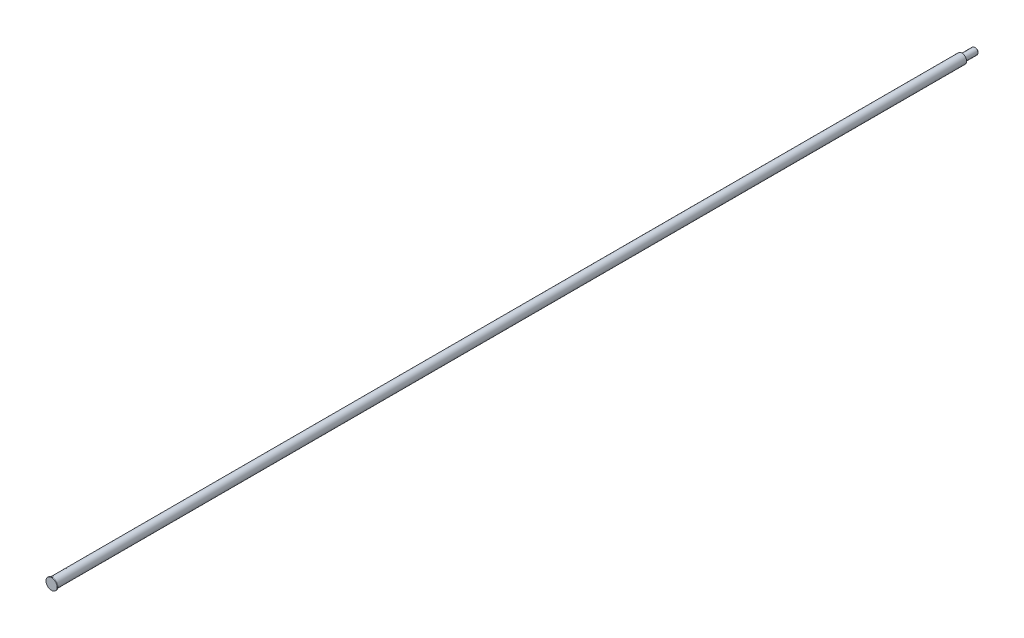
ISO-10303-21;
HEADER;
FILE_DESCRIPTION(('STEP AP214'),'2;1');
FILE_NAME('part.step','',(''),(''),'','','');
FILE_SCHEMA(('AUTOMOTIVE_DESIGN { 1 0 10303 214 1 1 1 1 }'));
ENDSEC;
DATA;
#1=APPLICATION_CONTEXT('core data for automotive mechanical design processes');
#2=APPLICATION_PROTOCOL_DEFINITION('international standard','automotive_design',2000,#1);
#3=PRODUCT_CONTEXT('',#1,'mechanical');
#4=PRODUCT('Part','Part','',(#3));
#5=PRODUCT_RELATED_PRODUCT_CATEGORY('part','',(#4));
#6=PRODUCT_DEFINITION_FORMATION('','',#4);
#7=PRODUCT_DEFINITION_CONTEXT('part definition',#1,'design');
#8=PRODUCT_DEFINITION('design','',#6,#7);
#9=PRODUCT_DEFINITION_SHAPE('','',#8);
#10=(LENGTH_UNIT() NAMED_UNIT(*) SI_UNIT(.MILLI.,.METRE.));
#11=(NAMED_UNIT(*) PLANE_ANGLE_UNIT() SI_UNIT($,.RADIAN.));
#12=(NAMED_UNIT(*) SI_UNIT($,.STERADIAN.) SOLID_ANGLE_UNIT());
#13=UNCERTAINTY_MEASURE_WITH_UNIT(LENGTH_MEASURE(1.E-05),#10,'distance_accuracy_value','');
#14=(GEOMETRIC_REPRESENTATION_CONTEXT(3) GLOBAL_UNCERTAINTY_ASSIGNED_CONTEXT((#13)) GLOBAL_UNIT_ASSIGNED_CONTEXT((#10,
#11,#12)) REPRESENTATION_CONTEXT('',''));
#15=CARTESIAN_POINT('',(0.,0.,0.));
#16=DIRECTION('',(0.,0.,1.));
#17=DIRECTION('',(1.,0.,0.));
#18=AXIS2_PLACEMENT_3D('',#15,#16,#17);
#19=CARTESIAN_POINT('',(0.,0.,0.));
#20=DIRECTION('',(0.,0.,-0.999999999999997));
#21=DIRECTION('',(-1.,0.,0.));
#22=AXIS2_PLACEMENT_3D('',#19,#20,#21);
#23=CYLINDRICAL_SURFACE('',#22,10.250000000029);
#24=CARTESIAN_POINT('',(0.,0.,0.));
#25=DIRECTION('',(0.,0.,-0.999999999999997));
#26=DIRECTION('',(-1.,0.,0.));
#27=AXIS2_PLACEMENT_3D('',#24,#25,#26);
#28=CIRCLE('',#27,10.250000000029);
#29=CARTESIAN_POINT('',(-10.250000000029,0.,0.));
#30=VERTEX_POINT('',#29);
#31=EDGE_CURVE('E12',#30,#30,#28,.T.);
#32=ORIENTED_EDGE('',*,*,#31,.T.);
#33=EDGE_LOOP('',(#32));
#34=FACE_BOUND('',#33,.T.);
#35=CARTESIAN_POINT('',(0.,0.,-1.60019999996042));
#36=DIRECTION('',(0.,0.,-0.999999999999997));
#37=DIRECTION('',(-1.,0.,0.));
#38=AXIS2_PLACEMENT_3D('',#35,#36,#37);
#39=CIRCLE('',#38,10.250000000029);
#40=CARTESIAN_POINT('',(-10.250000000029,0.,-1.60019999996042));
#41=VERTEX_POINT('',#40);
#42=EDGE_CURVE('E68',#41,#41,#39,.T.);
#43=ORIENTED_EDGE('',*,*,#42,.F.);
#44=EDGE_LOOP('',(#43));
#45=FACE_BOUND('',#44,.T.);
#46=ADVANCED_FACE('F40',(#34,#45),#23,.T.);
#47=CARTESIAN_POINT('',(10.250000000029,0.,0.));
#48=DIRECTION('',(0.,0.,0.999999999999997));
#49=DIRECTION('',(1.,0.,0.));
#50=AXIS2_PLACEMENT_3D('',#47,#48,#49);
#51=PLANE('',#50);
#52=ORIENTED_EDGE('',*,*,#31,.F.);
#53=EDGE_LOOP('',(#52));
#54=FACE_BOUND('',#53,.T.);
#55=ADVANCED_FACE('F76',(#54),#51,.T.);
#56=CARTESIAN_POINT('',(2.08569620855723E-13,0.,-1703.10019999999));
#57=DIRECTION('',(0.,0.,-0.999999999999997));
#58=DIRECTION('',(-1.,0.,0.));
#59=AXIS2_PLACEMENT_3D('',#56,#57,#58);
#60=PLANE('',#59);
#61=CARTESIAN_POINT('',(2.08569620855723E-13,0.,-1703.10019999999));
#62=DIRECTION('',(0.,0.,-0.999999999999997));
#63=DIRECTION('',(-1.,0.,0.));
#64=AXIS2_PLACEMENT_3D('',#61,#62,#63);
#65=CIRCLE('',#64,4.75000000000176);
#66=CARTESIAN_POINT('',(-4.75000000000155,0.,-1703.10019999999));
#67=VERTEX_POINT('',#66);
#68=EDGE_CURVE('E46',#67,#67,#65,.T.);
#69=ORIENTED_EDGE('',*,*,#68,.T.);
#70=EDGE_LOOP('',(#69));
#71=FACE_BOUND('',#70,.T.);
#72=ADVANCED_FACE('F80',(#71),#60,.T.);
#73=CARTESIAN_POINT('',(2.08569620855723E-13,0.,-1703.10019999999));
#74=DIRECTION('',(0.,0.,0.999999999999997));
#75=DIRECTION('',(1.,0.,0.));
#76=AXIS2_PLACEMENT_3D('',#73,#74,#75);
#77=CONICAL_SURFACE('',#76,4.75000000000176,0.785398163399052);
#78=CARTESIAN_POINT('',(2.0841654000583E-13,0.,-1701.85019999999));
#79=DIRECTION('',(0.,0.,-0.999999999999997));
#80=DIRECTION('',(-1.,0.,0.));
#81=AXIS2_PLACEMENT_3D('',#78,#79,#80);
#82=CIRCLE('',#81,6.00000000000041);
#83=CARTESIAN_POINT('',(-6.0000000000002,0.,-1701.85019999999));
#84=VERTEX_POINT('',#83);
#85=EDGE_CURVE('E50',#84,#84,#82,.T.);
#86=ORIENTED_EDGE('',*,*,#85,.T.);
#87=EDGE_LOOP('',(#86));
#88=FACE_BOUND('',#87,.T.);
#89=ORIENTED_EDGE('',*,*,#68,.F.);
#90=EDGE_LOOP('',(#89));
#91=FACE_BOUND('',#90,.T.);
#92=ADVANCED_FACE('F85',(#88,#91),#77,.T.);
#93=CARTESIAN_POINT('',(0.,0.,0.));
#94=DIRECTION('',(0.,0.,-0.999999999999997));
#95=DIRECTION('',(-1.,0.,0.));
#96=AXIS2_PLACEMENT_3D('',#93,#94,#95);
#97=CYLINDRICAL_SURFACE('',#96,6.00000000000038);
#98=CARTESIAN_POINT('',(2.05661084707747E-13,0.,-1679.35019999998));
#99=DIRECTION('',(0.,0.,-0.999999999999997));
#100=DIRECTION('',(-1.,0.,0.));
#101=AXIS2_PLACEMENT_3D('',#98,#99,#100);
#102=CIRCLE('',#101,6.00000000000035);
#103=CARTESIAN_POINT('',(-6.00000000000015,0.,-1679.35019999998));
#104=VERTEX_POINT('',#103);
#105=EDGE_CURVE('E54',#104,#104,#102,.T.);
#106=ORIENTED_EDGE('',*,*,#105,.T.);
#107=EDGE_LOOP('',(#106));
#108=FACE_BOUND('',#107,.T.);
#109=ORIENTED_EDGE('',*,*,#85,.F.);
#110=EDGE_LOOP('',(#109));
#111=FACE_BOUND('',#110,.T.);
#112=ADVANCED_FACE('F90',(#108,#111),#97,.T.);
#113=CARTESIAN_POINT('',(2.05661084707747E-13,0.,-1679.35019999998));
#114=DIRECTION('',(0.,0.,-0.999999999999997));
#115=DIRECTION('',(-1.,0.,0.));
#116=AXIS2_PLACEMENT_3D('',#113,#114,#115);
#117=CONICAL_SURFACE('',#116,6.00000000000035,0.785398163397331);
#118=CARTESIAN_POINT('',(2.0550800385785E-13,0.,-1678.10019999995));
#119=DIRECTION('',(0.,0.,-0.999999999999997));
#120=DIRECTION('',(-1.,0.,0.));
#121=AXIS2_PLACEMENT_3D('',#118,#119,#120);
#122=CIRCLE('',#121,4.74999999997336);
#123=CARTESIAN_POINT('',(-4.74999999997315,0.,-1678.10019999995));
#124=VERTEX_POINT('',#123);
#125=EDGE_CURVE('E59',#124,#124,#122,.T.);
#126=ORIENTED_EDGE('',*,*,#125,.T.);
#127=EDGE_LOOP('',(#126));
#128=FACE_BOUND('',#127,.T.);
#129=ORIENTED_EDGE('',*,*,#105,.F.);
#130=EDGE_LOOP('',(#129));
#131=FACE_BOUND('',#130,.T.);
#132=ADVANCED_FACE('F94',(#128,#131),#117,.T.);
#133=CARTESIAN_POINT('',(4.74999999997357,0.,-1678.10019999995));
#134=DIRECTION('',(0.,0.,-0.999999999999997));
#135=DIRECTION('',(-1.,0.,0.));
#136=AXIS2_PLACEMENT_3D('',#133,#134,#135);
#137=PLANE('',#136);
#138=CARTESIAN_POINT('',(2.0550800385785E-13,0.,-1678.10019999995));
#139=DIRECTION('',(0.,0.,-0.999999999999997));
#140=DIRECTION('',(-1.,0.,0.));
#141=AXIS2_PLACEMENT_3D('',#138,#139,#140);
#142=CIRCLE('',#141,8.75000000002894);
#143=CARTESIAN_POINT('',(-8.75000000002873,0.,-1678.10019999995));
#144=VERTEX_POINT('',#143);
#145=EDGE_CURVE('E62',#144,#144,#142,.T.);
#146=ORIENTED_EDGE('',*,*,#145,.T.);
#147=EDGE_LOOP('',(#146));
#148=FACE_BOUND('',#147,.T.);
#149=ORIENTED_EDGE('',*,*,#125,.F.);
#150=EDGE_LOOP('',(#149));
#151=FACE_BOUND('',#150,.T.);
#152=ADVANCED_FACE('F98',(#148,#151),#137,.T.);
#153=CARTESIAN_POINT('',(0.,0.,0.));
#154=DIRECTION('',(0.,0.,-0.999999999999997));
#155=DIRECTION('',(-1.,0.,0.));
#156=AXIS2_PLACEMENT_3D('',#153,#154,#155);
#157=CYLINDRICAL_SURFACE('',#156,8.75000000002897);
#158=CARTESIAN_POINT('',(0.,0.,-1.60019999996042));
#159=DIRECTION('',(0.,0.,-0.999999999999997));
#160=DIRECTION('',(-1.,0.,0.));
#161=AXIS2_PLACEMENT_3D('',#158,#159,#160);
#162=CIRCLE('',#161,8.750000000029);
#163=CARTESIAN_POINT('',(-8.750000000029,0.,-1.60019999996042));
#164=VERTEX_POINT('',#163);
#165=EDGE_CURVE('E65',#164,#164,#162,.T.);
#166=ORIENTED_EDGE('',*,*,#165,.T.);
#167=EDGE_LOOP('',(#166));
#168=FACE_BOUND('',#167,.T.);
#169=ORIENTED_EDGE('',*,*,#145,.F.);
#170=EDGE_LOOP('',(#169));
#171=FACE_BOUND('',#170,.T.);
#172=ADVANCED_FACE('F102',(#168,#171),#157,.T.);
#173=CARTESIAN_POINT('',(8.75000000002899,0.,-1.60019999996042));
#174=DIRECTION('',(0.,0.,-0.999999999999997));
#175=DIRECTION('',(-1.,0.,0.));
#176=AXIS2_PLACEMENT_3D('',#173,#174,#175);
#177=PLANE('',#176);
#178=ORIENTED_EDGE('',*,*,#42,.T.);
#179=EDGE_LOOP('',(#178));
#180=FACE_BOUND('',#179,.T.);
#181=ORIENTED_EDGE('',*,*,#165,.F.);
#182=EDGE_LOOP('',(#181));
#183=FACE_BOUND('',#182,.T.);
#184=ADVANCED_FACE('F72',(#180,#183),#177,.T.);
#185=CLOSED_SHELL('',(#46,#55,#72,#92,#112,#132,#152,#172,#184));
#186=MANIFOLD_SOLID_BREP('B2',#185);
#187=ADVANCED_BREP_SHAPE_REPRESENTATION('',(#18,#186),#14);
#188=SHAPE_DEFINITION_REPRESENTATION(#9,#187);
ENDSEC;
END-ISO-10303-21;
